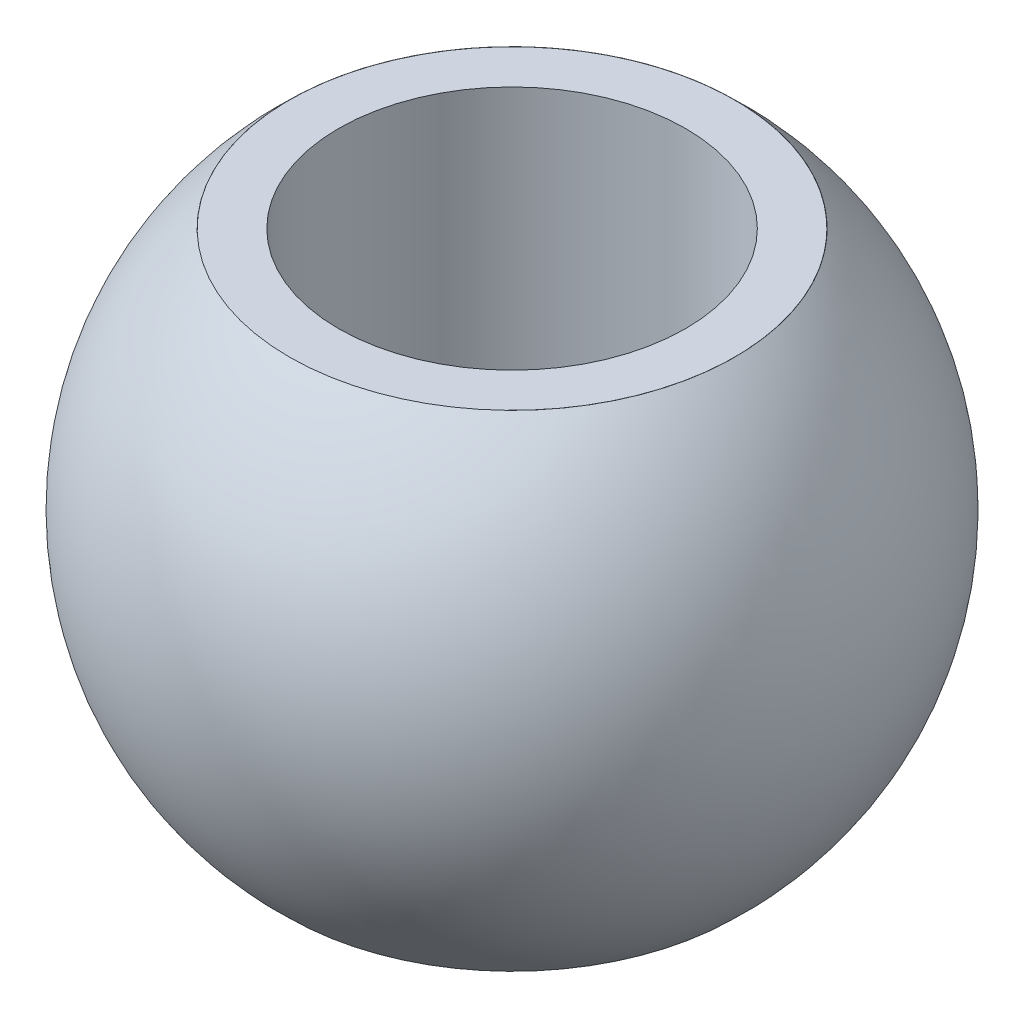
ISO-10303-21;
HEADER;
FILE_DESCRIPTION(('STEP AP214'),'2;1');
FILE_NAME('part.step','',(''),(''),'','','');
FILE_SCHEMA(('AUTOMOTIVE_DESIGN { 1 0 10303 214 1 1 1 1 }'));
ENDSEC;
DATA;
#1=APPLICATION_CONTEXT('core data for automotive mechanical design processes');
#2=APPLICATION_PROTOCOL_DEFINITION('international standard','automotive_design',2000,#1);
#3=PRODUCT_CONTEXT('',#1,'mechanical');
#4=PRODUCT('Part','Part','',(#3));
#5=PRODUCT_RELATED_PRODUCT_CATEGORY('part','',(#4));
#6=PRODUCT_DEFINITION_FORMATION('','',#4);
#7=PRODUCT_DEFINITION_CONTEXT('part definition',#1,'design');
#8=PRODUCT_DEFINITION('design','',#6,#7);
#9=PRODUCT_DEFINITION_SHAPE('','',#8);
#10=(LENGTH_UNIT() NAMED_UNIT(*) SI_UNIT(.MILLI.,.METRE.));
#11=(NAMED_UNIT(*) PLANE_ANGLE_UNIT() SI_UNIT($,.RADIAN.));
#12=(NAMED_UNIT(*) SI_UNIT($,.STERADIAN.) SOLID_ANGLE_UNIT());
#13=UNCERTAINTY_MEASURE_WITH_UNIT(LENGTH_MEASURE(1.E-05),#10,'distance_accuracy_value','');
#14=(GEOMETRIC_REPRESENTATION_CONTEXT(3) GLOBAL_UNCERTAINTY_ASSIGNED_CONTEXT((#13)) GLOBAL_UNIT_ASSIGNED_CONTEXT((#10,
#11,#12)) REPRESENTATION_CONTEXT('',''));
#15=CARTESIAN_POINT('',(0.,0.,0.));
#16=DIRECTION('',(0.,0.,1.));
#17=DIRECTION('',(1.,0.,0.));
#18=AXIS2_PLACEMENT_3D('',#15,#16,#17);
#19=CARTESIAN_POINT('',(0.,0.,0.));
#20=DIRECTION('',(-1.,0.,0.));
#21=DIRECTION('',(0.,0.,-1.));
#22=AXIS2_PLACEMENT_3D('',#19,#20,#21);
#23=SPHERICAL_SURFACE('',#22,9.5);
#24=CARTESIAN_POINT('',(0.,0.,0.));
#25=DIRECTION('',(0.,1.,0.));
#26=DIRECTION('',(0.,0.,1.));
#27=AXIS2_PLACEMENT_3D('',#24,#25,#26);
#28=SPHERICAL_SURFACE('',#27,9.5);
#29=CARTESIAN_POINT('',(0.,-7.00239958871243,0.));
#30=DIRECTION('',(0.,1.,0.));
#31=DIRECTION('',(0.,0.,1.));
#32=AXIS2_PLACEMENT_3D('',#29,#30,#31);
#33=CIRCLE('',#32,6.42);
#34=CARTESIAN_POINT('',(0.,-7.00239958871243,6.42));
#35=VERTEX_POINT('',#34);
#36=EDGE_CURVE('E40',#35,#35,#33,.T.);
#37=ORIENTED_EDGE('',*,*,#36,.T.);
#38=EDGE_LOOP('',(#37));
#39=FACE_BOUND('',#38,.T.);
#40=CARTESIAN_POINT('',(0.,7.00239958871243,0.));
#41=DIRECTION('',(0.,-1.,0.));
#42=DIRECTION('',(0.,0.,-1.));
#43=AXIS2_PLACEMENT_3D('',#40,#41,#42);
#44=CIRCLE('',#43,6.42);
#45=CARTESIAN_POINT('',(0.,7.00239958871243,-6.42));
#46=VERTEX_POINT('',#45);
#47=EDGE_CURVE('E10',#46,#46,#44,.F.);
#48=ORIENTED_EDGE('',*,*,#47,.F.);
#49=EDGE_LOOP('',(#48));
#50=FACE_BOUND('',#49,.T.);
#51=ADVANCED_FACE('F37',(#39,#50),#28,.T.);
#52=CARTESIAN_POINT('',(0.,-9.5,0.));
#53=DIRECTION('',(0.,1.,0.));
#54=DIRECTION('',(0.,0.,1.));
#55=AXIS2_PLACEMENT_3D('',#52,#53,#54);
#56=CYLINDRICAL_SURFACE('',#55,5.);
#57=CARTESIAN_POINT('',(0.,-7.,0.));
#58=DIRECTION('',(0.,1.,0.));
#59=DIRECTION('',(0.,0.,1.));
#60=AXIS2_PLACEMENT_3D('',#57,#58,#59);
#61=CIRCLE('',#60,5.);
#62=CARTESIAN_POINT('',(0.,-7.,5.));
#63=VERTEX_POINT('',#62);
#64=EDGE_CURVE('E56',#63,#63,#61,.T.);
#65=ORIENTED_EDGE('',*,*,#64,.F.);
#66=EDGE_LOOP('',(#65));
#67=FACE_BOUND('',#66,.T.);
#68=CARTESIAN_POINT('',(0.,7.,0.));
#69=DIRECTION('',(0.,1.,0.));
#70=DIRECTION('',(0.,0.,1.));
#71=AXIS2_PLACEMENT_3D('',#68,#69,#70);
#72=CIRCLE('',#71,5.);
#73=CARTESIAN_POINT('',(0.,7.,5.));
#74=VERTEX_POINT('',#73);
#75=EDGE_CURVE('E48',#74,#74,#72,.T.);
#76=ORIENTED_EDGE('',*,*,#75,.T.);
#77=EDGE_LOOP('',(#76));
#78=FACE_BOUND('',#77,.T.);
#79=ADVANCED_FACE('F63',(#67,#78),#56,.F.);
#80=CARTESIAN_POINT('',(0.,8.07774721070176,0.));
#81=DIRECTION('',(0.,-1.,0.));
#82=DIRECTION('',(0.,0.,-1.));
#83=AXIS2_PLACEMENT_3D('',#80,#81,#82);
#84=CYLINDRICAL_SURFACE('',#83,6.42);
#85=CARTESIAN_POINT('',(0.,7.,0.));
#86=DIRECTION('',(0.,1.,0.));
#87=DIRECTION('',(0.,0.,1.));
#88=AXIS2_PLACEMENT_3D('',#85,#86,#87);
#89=CIRCLE('',#88,6.42);
#90=CARTESIAN_POINT('',(0.,7.,6.42));
#91=VERTEX_POINT('',#90);
#92=EDGE_CURVE('E44',#91,#91,#89,.T.);
#93=ORIENTED_EDGE('',*,*,#92,.F.);
#94=EDGE_LOOP('',(#93));
#95=FACE_BOUND('',#94,.T.);
#96=ORIENTED_EDGE('',*,*,#47,.T.);
#97=EDGE_LOOP('',(#96));
#98=FACE_BOUND('',#97,.T.);
#99=ADVANCED_FACE('F66',(#95,#98),#84,.F.);
#100=CARTESIAN_POINT('',(0.,7.,0.));
#101=DIRECTION('',(0.,1.,0.));
#102=DIRECTION('',(0.,0.,1.));
#103=AXIS2_PLACEMENT_3D('',#100,#101,#102);
#104=PLANE('',#103);
#105=ORIENTED_EDGE('',*,*,#75,.F.);
#106=EDGE_LOOP('',(#105));
#107=FACE_BOUND('',#106,.T.);
#108=ORIENTED_EDGE('',*,*,#92,.T.);
#109=EDGE_LOOP('',(#108));
#110=FACE_BOUND('',#109,.T.);
#111=ADVANCED_FACE('F69',(#107,#110),#104,.T.);
#112=CARTESIAN_POINT('',(0.,-8.07774721070176,0.));
#113=DIRECTION('',(0.,1.,0.));
#114=DIRECTION('',(0.,0.,1.));
#115=AXIS2_PLACEMENT_3D('',#112,#113,#114);
#116=CYLINDRICAL_SURFACE('',#115,6.42);
#117=CARTESIAN_POINT('',(0.,-7.,0.));
#118=DIRECTION('',(0.,1.,0.));
#119=DIRECTION('',(0.,0.,1.));
#120=AXIS2_PLACEMENT_3D('',#117,#118,#119);
#121=CIRCLE('',#120,6.42);
#122=CARTESIAN_POINT('',(0.,-7.,6.42));
#123=VERTEX_POINT('',#122);
#124=EDGE_CURVE('E53',#123,#123,#121,.T.);
#125=ORIENTED_EDGE('',*,*,#124,.T.);
#126=EDGE_LOOP('',(#125));
#127=FACE_BOUND('',#126,.T.);
#128=ORIENTED_EDGE('',*,*,#36,.F.);
#129=EDGE_LOOP('',(#128));
#130=FACE_BOUND('',#129,.T.);
#131=ADVANCED_FACE('F72',(#127,#130),#116,.F.);
#132=CARTESIAN_POINT('',(0.,-7.,0.));
#133=DIRECTION('',(0.,1.,0.));
#134=DIRECTION('',(0.,0.,1.));
#135=AXIS2_PLACEMENT_3D('',#132,#133,#134);
#136=PLANE('',#135);
#137=ORIENTED_EDGE('',*,*,#64,.T.);
#138=EDGE_LOOP('',(#137));
#139=FACE_BOUND('',#138,.T.);
#140=ORIENTED_EDGE('',*,*,#124,.F.);
#141=EDGE_LOOP('',(#140));
#142=FACE_BOUND('',#141,.T.);
#143=ADVANCED_FACE('F60',(#139,#142),#136,.F.);
#144=CLOSED_SHELL('',(#51,#79,#99,#111,#131,#143));
#145=MANIFOLD_SOLID_BREP('B2',#144);
#146=ADVANCED_BREP_SHAPE_REPRESENTATION('',(#18,#145),#14);
#147=SHAPE_DEFINITION_REPRESENTATION(#9,#146);
ENDSEC;
END-ISO-10303-21;
